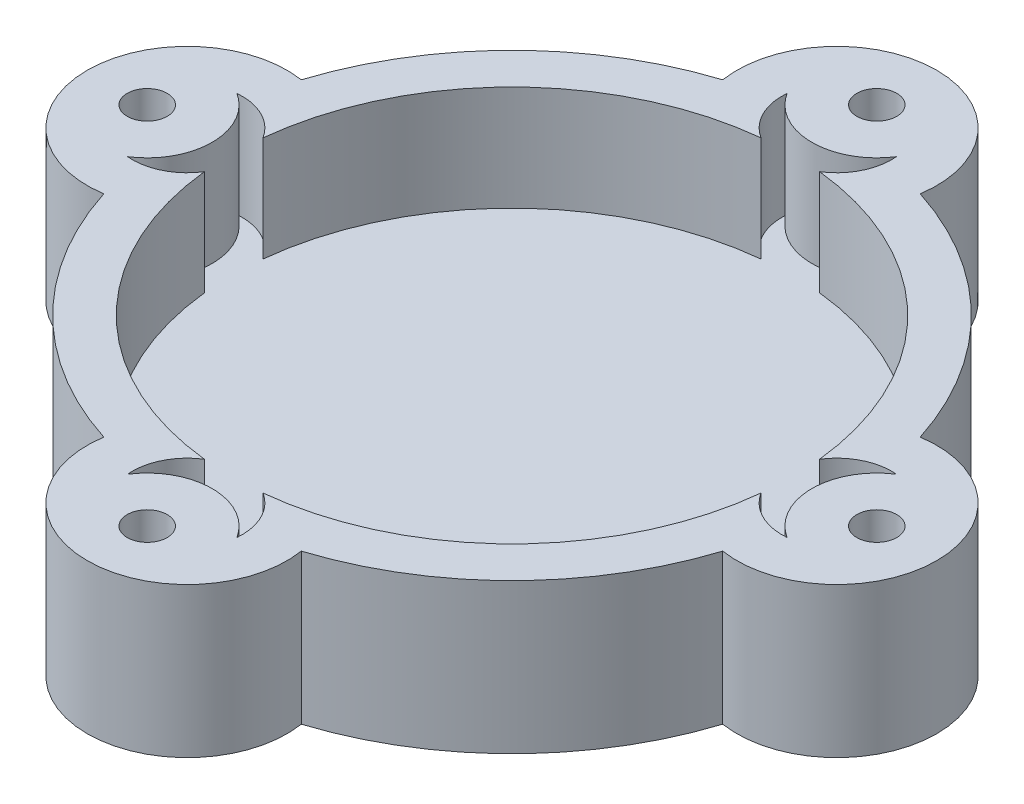
ISO-10303-21;
HEADER;
FILE_DESCRIPTION(('STEP AP214'),'2;1');
FILE_NAME('part.step','',(''),(''),'','','');
FILE_SCHEMA(('AUTOMOTIVE_DESIGN { 1 0 10303 214 1 1 1 1 }'));
ENDSEC;
DATA;
#1=APPLICATION_CONTEXT('core data for automotive mechanical design processes');
#2=APPLICATION_PROTOCOL_DEFINITION('international standard','automotive_design',2000,#1);
#3=PRODUCT_CONTEXT('',#1,'mechanical');
#4=PRODUCT('Part','Part','',(#3));
#5=PRODUCT_RELATED_PRODUCT_CATEGORY('part','',(#4));
#6=PRODUCT_DEFINITION_FORMATION('','',#4);
#7=PRODUCT_DEFINITION_CONTEXT('part definition',#1,'design');
#8=PRODUCT_DEFINITION('design','',#6,#7);
#9=PRODUCT_DEFINITION_SHAPE('','',#8);
#10=(LENGTH_UNIT() NAMED_UNIT(*) SI_UNIT(.MILLI.,.METRE.));
#11=(NAMED_UNIT(*) PLANE_ANGLE_UNIT() SI_UNIT($,.RADIAN.));
#12=(NAMED_UNIT(*) SI_UNIT($,.STERADIAN.) SOLID_ANGLE_UNIT());
#13=UNCERTAINTY_MEASURE_WITH_UNIT(LENGTH_MEASURE(1.E-05),#10,'distance_accuracy_value','');
#14=(GEOMETRIC_REPRESENTATION_CONTEXT(3) GLOBAL_UNCERTAINTY_ASSIGNED_CONTEXT((#13)) GLOBAL_UNIT_ASSIGNED_CONTEXT((#10,
#11,#12)) REPRESENTATION_CONTEXT('',''));
#15=CARTESIAN_POINT('',(0.,0.,0.));
#16=DIRECTION('',(0.,0.,1.));
#17=DIRECTION('',(1.,0.,0.));
#18=AXIS2_PLACEMENT_3D('',#15,#16,#17);
#19=CARTESIAN_POINT('',(-64.9999999999963,30.,3.69482222595252E-12));
#20=DIRECTION('',(0.,-1.,0.));
#21=DIRECTION('',(0.,0.,-1.));
#22=AXIS2_PLACEMENT_3D('',#19,#20,#21);
#23=CYLINDRICAL_SURFACE('',#22,20.);
#24=CARTESIAN_POINT('',(-64.9999999999963,0.,3.69482222595252E-12));
#25=DIRECTION('',(0.,1.,0.));
#26=DIRECTION('',(0.,0.,1.));
#27=AXIS2_PLACEMENT_3D('',#24,#25,#26);
#28=CIRCLE('',#27,20.);
#29=CARTESIAN_POINT('',(-61.9230769230779,0.,-19.7618962748665));
#30=VERTEX_POINT('',#29);
#31=CARTESIAN_POINT('',(-61.9230769230756,0.,19.7618962748735));
#32=VERTEX_POINT('',#31);
#33=EDGE_CURVE('E176',#30,#32,#28,.T.);
#34=ORIENTED_EDGE('',*,*,#33,.T.);
#35=DIRECTION('',(0.,-1.,0.));
#36=VECTOR('',#35,1.);
#37=CARTESIAN_POINT('',(-61.9230769230756,30.,19.7618962748735));
#38=LINE('',#37,#36);
#39=CARTESIAN_POINT('',(-61.9230769230756,30.,19.7618962748735));
#40=VERTEX_POINT('',#39);
#41=EDGE_CURVE('E11',#40,#32,#38,.T.);
#42=ORIENTED_EDGE('',*,*,#41,.F.);
#43=CARTESIAN_POINT('',(-64.9999999999963,30.,3.69482222595252E-12));
#44=DIRECTION('',(0.,1.,0.));
#45=DIRECTION('',(0.,0.,1.));
#46=AXIS2_PLACEMENT_3D('',#43,#44,#45);
#47=CIRCLE('',#46,20.);
#48=CARTESIAN_POINT('',(-61.9230769230779,30.,-19.7618962748665));
#49=VERTEX_POINT('',#48);
#50=EDGE_CURVE('E242',#49,#40,#47,.T.);
#51=ORIENTED_EDGE('',*,*,#50,.F.);
#52=DIRECTION('',(0.,-1.,0.));
#53=VECTOR('',#52,1.);
#54=CARTESIAN_POINT('',(-61.9230769230779,30.,-19.7618962748665));
#55=LINE('',#54,#53);
#56=EDGE_CURVE('E171',#49,#30,#55,.T.);
#57=ORIENTED_EDGE('',*,*,#56,.T.);
#58=EDGE_LOOP('',(#34,#42,#51,#57));
#59=FACE_BOUND('',#58,.T.);
#60=ADVANCED_FACE('F45',(#59),#23,.T.);
#61=CARTESIAN_POINT('',(0.,30.,0.));
#62=DIRECTION('',(0.,-1.,0.));
#63=DIRECTION('',(0.,0.,-1.));
#64=AXIS2_PLACEMENT_3D('',#61,#62,#63);
#65=CYLINDRICAL_SURFACE('',#64,65.);
#66=CARTESIAN_POINT('',(0.,0.,0.));
#67=DIRECTION('',(0.,1.,0.));
#68=DIRECTION('',(0.,0.,1.));
#69=AXIS2_PLACEMENT_3D('',#66,#67,#68);
#70=CIRCLE('',#69,65.);
#71=CARTESIAN_POINT('',(-19.7618962748624,0.,61.9230769230792));
#72=VERTEX_POINT('',#71);
#73=EDGE_CURVE('E181',#32,#72,#70,.T.);
#74=ORIENTED_EDGE('',*,*,#73,.T.);
#75=DIRECTION('',(0.,-1.,0.));
#76=VECTOR('',#75,1.);
#77=CARTESIAN_POINT('',(-19.7618962748624,30.,61.9230769230792));
#78=LINE('',#77,#76);
#79=CARTESIAN_POINT('',(-19.7618962748624,30.,61.9230769230792));
#80=VERTEX_POINT('',#79);
#81=EDGE_CURVE('E54',#80,#72,#78,.T.);
#82=ORIENTED_EDGE('',*,*,#81,.F.);
#83=CARTESIAN_POINT('',(0.,30.,0.));
#84=DIRECTION('',(0.,1.,0.));
#85=DIRECTION('',(0.,0.,1.));
#86=AXIS2_PLACEMENT_3D('',#83,#84,#85);
#87=CIRCLE('',#86,65.);
#88=EDGE_CURVE('E111',#40,#80,#87,.T.);
#89=ORIENTED_EDGE('',*,*,#88,.F.);
#90=ORIENTED_EDGE('',*,*,#41,.T.);
#91=EDGE_LOOP('',(#74,#82,#89,#90));
#92=FACE_BOUND('',#91,.T.);
#93=ADVANCED_FACE('F578',(#92),#65,.T.);
#94=CARTESIAN_POINT('',(7.37372404351613E-12,30.,65.));
#95=DIRECTION('',(0.,-1.,0.));
#96=DIRECTION('',(0.,0.,-1.));
#97=AXIS2_PLACEMENT_3D('',#94,#95,#96);
#98=CYLINDRICAL_SURFACE('',#97,20.);
#99=CARTESIAN_POINT('',(7.37372404351613E-12,0.,65.));
#100=DIRECTION('',(0.,1.,0.));
#101=DIRECTION('',(0.,0.,1.));
#102=AXIS2_PLACEMENT_3D('',#99,#100,#101);
#103=CIRCLE('',#102,20.);
#104=CARTESIAN_POINT('',(19.7618962748765,0.,61.9230769230747));
#105=VERTEX_POINT('',#104);
#106=EDGE_CURVE('E184',#72,#105,#103,.T.);
#107=ORIENTED_EDGE('',*,*,#106,.T.);
#108=DIRECTION('',(0.,-1.,0.));
#109=VECTOR('',#108,1.);
#110=CARTESIAN_POINT('',(19.7618962748765,30.,61.9230769230747));
#111=LINE('',#110,#109);
#112=CARTESIAN_POINT('',(19.7618962748765,30.,61.9230769230747));
#113=VERTEX_POINT('',#112);
#114=EDGE_CURVE('E217',#113,#105,#111,.T.);
#115=ORIENTED_EDGE('',*,*,#114,.F.);
#116=CARTESIAN_POINT('',(7.37372404351613E-12,30.,65.));
#117=DIRECTION('',(0.,1.,0.));
#118=DIRECTION('',(0.,0.,1.));
#119=AXIS2_PLACEMENT_3D('',#116,#117,#118);
#120=CIRCLE('',#119,20.);
#121=EDGE_CURVE('E227',#80,#113,#120,.T.);
#122=ORIENTED_EDGE('',*,*,#121,.F.);
#123=ORIENTED_EDGE('',*,*,#81,.T.);
#124=EDGE_LOOP('',(#107,#115,#122,#123));
#125=FACE_BOUND('',#124,.T.);
#126=ADVANCED_FACE('F225',(#125),#98,.T.);
#127=CARTESIAN_POINT('',(61.9230769230795,0.,19.7618962748654));
#128=VERTEX_POINT('',#127);
#129=EDGE_CURVE('E185',#105,#128,#70,.T.);
#130=ORIENTED_EDGE('',*,*,#129,.T.);
#131=DIRECTION('',(0.,-1.,0.));
#132=VECTOR('',#131,1.);
#133=CARTESIAN_POINT('',(61.9230769230795,30.,19.7618962748654));
#134=LINE('',#133,#132);
#135=CARTESIAN_POINT('',(61.9230769230795,30.,19.7618962748654));
#136=VERTEX_POINT('',#135);
#137=EDGE_CURVE('E213',#136,#128,#134,.T.);
#138=ORIENTED_EDGE('',*,*,#137,.F.);
#139=EDGE_CURVE('E140',#113,#136,#87,.T.);
#140=ORIENTED_EDGE('',*,*,#139,.F.);
#141=ORIENTED_EDGE('',*,*,#114,.T.);
#142=EDGE_LOOP('',(#130,#138,#140,#141));
#143=FACE_BOUND('',#142,.T.);
#144=ADVANCED_FACE('F584',(#143),#65,.T.);
#145=CARTESIAN_POINT('',(65.0000000000037,30.,-3.68686202175806E-12));
#146=DIRECTION('',(0.,-1.,0.));
#147=DIRECTION('',(0.,0.,-1.));
#148=AXIS2_PLACEMENT_3D('',#145,#146,#147);
#149=CYLINDRICAL_SURFACE('',#148,20.);
#150=CARTESIAN_POINT('',(65.0000000000037,0.,-3.68686202175806E-12));
#151=DIRECTION('',(0.,1.,0.));
#152=DIRECTION('',(0.,0.,1.));
#153=AXIS2_PLACEMENT_3D('',#150,#151,#152);
#154=CIRCLE('',#153,20.);
#155=CARTESIAN_POINT('',(61.9230769230784,0.,-19.7618962748724));
#156=VERTEX_POINT('',#155);
#157=EDGE_CURVE('E188',#128,#156,#154,.T.);
#158=ORIENTED_EDGE('',*,*,#157,.T.);
#159=DIRECTION('',(0.,-1.,0.));
#160=VECTOR('',#159,1.);
#161=CARTESIAN_POINT('',(61.9230769230784,30.,-19.7618962748724));
#162=LINE('',#161,#160);
#163=CARTESIAN_POINT('',(61.9230769230784,30.,-19.7618962748724));
#164=VERTEX_POINT('',#163);
#165=EDGE_CURVE('E149',#164,#156,#162,.T.);
#166=ORIENTED_EDGE('',*,*,#165,.F.);
#167=CARTESIAN_POINT('',(65.0000000000037,30.,-3.68686202175806E-12));
#168=DIRECTION('',(0.,1.,0.));
#169=DIRECTION('',(0.,0.,1.));
#170=AXIS2_PLACEMENT_3D('',#167,#168,#169);
#171=CIRCLE('',#170,20.);
#172=EDGE_CURVE('E134',#136,#164,#171,.T.);
#173=ORIENTED_EDGE('',*,*,#172,.F.);
#174=ORIENTED_EDGE('',*,*,#137,.T.);
#175=EDGE_LOOP('',(#158,#166,#173,#174));
#176=FACE_BOUND('',#175,.T.);
#177=ADVANCED_FACE('F589',(#176),#149,.T.);
#178=CARTESIAN_POINT('',(19.7618962748694,0.,-61.9230769230769));
#179=VERTEX_POINT('',#178);
#180=EDGE_CURVE('E145',#156,#179,#70,.T.);
#181=ORIENTED_EDGE('',*,*,#180,.T.);
#182=DIRECTION('',(0.,-1.,0.));
#183=VECTOR('',#182,1.);
#184=CARTESIAN_POINT('',(19.7618962748694,30.,-61.9230769230769));
#185=LINE('',#184,#183);
#186=CARTESIAN_POINT('',(19.7618962748694,30.,-61.9230769230769));
#187=VERTEX_POINT('',#186);
#188=EDGE_CURVE('E142',#187,#179,#185,.T.);
#189=ORIENTED_EDGE('',*,*,#188,.F.);
#190=EDGE_CURVE('E126',#164,#187,#87,.T.);
#191=ORIENTED_EDGE('',*,*,#190,.F.);
#192=ORIENTED_EDGE('',*,*,#165,.T.);
#193=EDGE_LOOP('',(#181,#189,#191,#192));
#194=FACE_BOUND('',#193,.T.);
#195=ADVANCED_FACE('F143',(#194),#65,.T.);
#196=CARTESIAN_POINT('',(0.,30.,-65.));
#197=DIRECTION('',(0.,-1.,0.));
#198=DIRECTION('',(0.,0.,-1.));
#199=AXIS2_PLACEMENT_3D('',#196,#197,#198);
#200=CYLINDRICAL_SURFACE('',#199,20.);
#201=CARTESIAN_POINT('',(0.,0.,-65.));
#202=DIRECTION('',(0.,1.,0.));
#203=DIRECTION('',(0.,0.,1.));
#204=AXIS2_PLACEMENT_3D('',#201,#202,#203);
#205=CIRCLE('',#204,20.);
#206=CARTESIAN_POINT('',(-19.7618962748694,0.,-61.9230769230769));
#207=VERTEX_POINT('',#206);
#208=EDGE_CURVE('E191',#179,#207,#205,.T.);
#209=ORIENTED_EDGE('',*,*,#208,.T.);
#210=DIRECTION('',(0.,-1.,0.));
#211=VECTOR('',#210,1.);
#212=CARTESIAN_POINT('',(-19.7618962748694,30.,-61.9230769230769));
#213=LINE('',#212,#211);
#214=CARTESIAN_POINT('',(-19.7618962748694,30.,-61.9230769230769));
#215=VERTEX_POINT('',#214);
#216=EDGE_CURVE('E150',#215,#207,#213,.T.);
#217=ORIENTED_EDGE('',*,*,#216,.F.);
#218=CARTESIAN_POINT('',(0.,30.,-65.));
#219=DIRECTION('',(0.,1.,0.));
#220=DIRECTION('',(0.,0.,1.));
#221=AXIS2_PLACEMENT_3D('',#218,#219,#220);
#222=CIRCLE('',#221,20.);
#223=EDGE_CURVE('E131',#187,#215,#222,.T.);
#224=ORIENTED_EDGE('',*,*,#223,.F.);
#225=ORIENTED_EDGE('',*,*,#188,.T.);
#226=EDGE_LOOP('',(#209,#217,#224,#225));
#227=FACE_BOUND('',#226,.T.);
#228=ADVANCED_FACE('F152',(#227),#200,.T.);
#229=CARTESIAN_POINT('',(73.0000000000037,30.,-3.68735188047772E-12));
#230=DIRECTION('',(0.,-1.,0.));
#231=DIRECTION('',(0.,0.,-1.));
#232=AXIS2_PLACEMENT_3D('',#229,#230,#231);
#233=CYLINDRICAL_SURFACE('',#232,4.0000000000027);
#234=CARTESIAN_POINT('',(73.0000000000037,30.,-3.68735188047772E-12));
#235=DIRECTION('',(0.,1.,0.));
#236=DIRECTION('',(0.,0.,1.));
#237=AXIS2_PLACEMENT_3D('',#234,#235,#236);
#238=CIRCLE('',#237,4.0000000000027);
#239=CARTESIAN_POINT('',(73.0000000000037,30.,3.99999999999901));
#240=VERTEX_POINT('',#239);
#241=EDGE_CURVE('E163',#240,#240,#238,.T.);
#242=ORIENTED_EDGE('',*,*,#241,.T.);
#243=EDGE_LOOP('',(#242));
#244=FACE_BOUND('',#243,.T.);
#245=CARTESIAN_POINT('',(73.0000000000037,0.,-3.68735188047772E-12));
#246=DIRECTION('',(0.,1.,0.));
#247=DIRECTION('',(0.,0.,1.));
#248=AXIS2_PLACEMENT_3D('',#245,#246,#247);
#249=CIRCLE('',#248,4.0000000000027);
#250=CARTESIAN_POINT('',(73.0000000000037,0.,3.99999999999901));
#251=VERTEX_POINT('',#250);
#252=EDGE_CURVE('E198',#251,#251,#249,.T.);
#253=ORIENTED_EDGE('',*,*,#252,.F.);
#254=EDGE_LOOP('',(#253));
#255=FACE_BOUND('',#254,.T.);
#256=ADVANCED_FACE('F594',(#244,#255),#233,.F.);
#257=CARTESIAN_POINT('',(0.,30.,-73.));
#258=DIRECTION('',(0.,-1.,0.));
#259=DIRECTION('',(0.,0.,-1.));
#260=AXIS2_PLACEMENT_3D('',#257,#258,#259);
#261=CYLINDRICAL_SURFACE('',#260,4.);
#262=CARTESIAN_POINT('',(0.,30.,-73.));
#263=DIRECTION('',(0.,1.,0.));
#264=DIRECTION('',(0.,0.,1.));
#265=AXIS2_PLACEMENT_3D('',#262,#263,#264);
#266=CIRCLE('',#265,4.);
#267=CARTESIAN_POINT('',(0.,30.,-69.));
#268=VERTEX_POINT('',#267);
#269=EDGE_CURVE('E156',#268,#268,#266,.T.);
#270=ORIENTED_EDGE('',*,*,#269,.T.);
#271=EDGE_LOOP('',(#270));
#272=FACE_BOUND('',#271,.T.);
#273=CARTESIAN_POINT('',(0.,0.,-73.));
#274=DIRECTION('',(0.,1.,0.));
#275=DIRECTION('',(0.,0.,1.));
#276=AXIS2_PLACEMENT_3D('',#273,#274,#275);
#277=CIRCLE('',#276,4.);
#278=CARTESIAN_POINT('',(0.,0.,-69.));
#279=VERTEX_POINT('',#278);
#280=EDGE_CURVE('E194',#279,#279,#277,.T.);
#281=ORIENTED_EDGE('',*,*,#280,.F.);
#282=EDGE_LOOP('',(#281));
#283=FACE_BOUND('',#282,.T.);
#284=ADVANCED_FACE('F597',(#272,#283),#261,.F.);
#285=EDGE_CURVE('E103',#207,#30,#70,.T.);
#286=ORIENTED_EDGE('',*,*,#285,.T.);
#287=ORIENTED_EDGE('',*,*,#56,.F.);
#288=EDGE_CURVE('E70',#215,#49,#87,.T.);
#289=ORIENTED_EDGE('',*,*,#288,.F.);
#290=ORIENTED_EDGE('',*,*,#216,.T.);
#291=EDGE_LOOP('',(#286,#287,#289,#290));
#292=FACE_BOUND('',#291,.T.);
#293=ADVANCED_FACE('F585',(#292),#65,.T.);
#294=CARTESIAN_POINT('',(-72.9999999999963,30.,3.6962918021115E-12));
#295=DIRECTION('',(0.,-1.,0.));
#296=DIRECTION('',(0.,0.,-1.));
#297=AXIS2_PLACEMENT_3D('',#294,#295,#296);
#298=CYLINDRICAL_SURFACE('',#297,4.00000000000534);
#299=CARTESIAN_POINT('',(-72.9999999999963,30.,3.6962918021115E-12));
#300=DIRECTION('',(0.,1.,0.));
#301=DIRECTION('',(0.,0.,1.));
#302=AXIS2_PLACEMENT_3D('',#299,#300,#301);
#303=CIRCLE('',#302,4.00000000000534);
#304=CARTESIAN_POINT('',(-72.9999999999963,30.,4.00000000000904));
#305=VERTEX_POINT('',#304);
#306=EDGE_CURVE('E206',#305,#305,#303,.T.);
#307=ORIENTED_EDGE('',*,*,#306,.T.);
#308=EDGE_LOOP('',(#307));
#309=FACE_BOUND('',#308,.T.);
#310=CARTESIAN_POINT('',(-72.9999999999963,0.,3.6962918021115E-12));
#311=DIRECTION('',(0.,1.,0.));
#312=DIRECTION('',(0.,0.,1.));
#313=AXIS2_PLACEMENT_3D('',#310,#311,#312);
#314=CIRCLE('',#313,4.00000000000534);
#315=CARTESIAN_POINT('',(-72.9999999999963,0.,4.00000000000904));
#316=VERTEX_POINT('',#315);
#317=EDGE_CURVE('E172',#316,#316,#314,.T.);
#318=ORIENTED_EDGE('',*,*,#317,.F.);
#319=EDGE_LOOP('',(#318));
#320=FACE_BOUND('',#319,.T.);
#321=ADVANCED_FACE('F47',(#309,#320),#298,.F.);
#322=CARTESIAN_POINT('',(7.37470376095544E-12,30.,73.));
#323=DIRECTION('',(0.,-1.,0.));
#324=DIRECTION('',(0.,0.,-1.));
#325=AXIS2_PLACEMENT_3D('',#322,#323,#324);
#326=CYLINDRICAL_SURFACE('',#325,4.00000000000754);
#327=CARTESIAN_POINT('',(7.37470376095544E-12,30.,73.));
#328=DIRECTION('',(0.,1.,0.));
#329=DIRECTION('',(0.,0.,1.));
#330=AXIS2_PLACEMENT_3D('',#327,#328,#329);
#331=CIRCLE('',#330,4.00000000000754);
#332=CARTESIAN_POINT('',(7.37470376095544E-12,30.,77.0000000000075));
#333=VERTEX_POINT('',#332);
#334=EDGE_CURVE('E167',#333,#333,#331,.T.);
#335=ORIENTED_EDGE('',*,*,#334,.T.);
#336=EDGE_LOOP('',(#335));
#337=FACE_BOUND('',#336,.T.);
#338=CARTESIAN_POINT('',(7.37470376095544E-12,0.,73.));
#339=DIRECTION('',(0.,1.,0.));
#340=DIRECTION('',(0.,0.,1.));
#341=AXIS2_PLACEMENT_3D('',#338,#339,#340);
#342=CIRCLE('',#341,4.00000000000754);
#343=CARTESIAN_POINT('',(7.37470376095544E-12,0.,77.0000000000075));
#344=VERTEX_POINT('',#343);
#345=EDGE_CURVE('E202',#344,#344,#342,.T.);
#346=ORIENTED_EDGE('',*,*,#345,.F.);
#347=EDGE_LOOP('',(#346));
#348=FACE_BOUND('',#347,.T.);
#349=ADVANCED_FACE('F604',(#337,#348),#326,.F.);
#350=CARTESIAN_POINT('',(0.,30.,0.));
#351=DIRECTION('',(0.,1.,0.));
#352=DIRECTION('',(0.,0.,1.));
#353=AXIS2_PLACEMENT_3D('',#350,#351,#352);
#354=PLANE('',#353);
#355=CARTESIAN_POINT('',(7.37372404351613E-12,30.,65.));
#356=DIRECTION('',(0.,1.,0.));
#357=DIRECTION('',(0.,0.,1.));
#358=AXIS2_PLACEMENT_3D('',#355,#356,#357);
#359=CIRCLE('',#358,11.);
#360=CARTESIAN_POINT('',(-5.86232581022681,30.,55.6923076923084));
#361=VERTEX_POINT('',#360);
#362=CARTESIAN_POINT('',(-10.9544511500971,30.,65.9999999999878));
#363=VERTEX_POINT('',#362);
#364=EDGE_CURVE('E323',#361,#363,#359,.T.);
#365=ORIENTED_EDGE('',*,*,#364,.F.);
#366=CARTESIAN_POINT('',(0.,30.,0.));
#367=DIRECTION('',(0.,1.,0.));
#368=DIRECTION('',(0.,0.,1.));
#369=AXIS2_PLACEMENT_3D('',#366,#367,#368);
#370=CIRCLE('',#369,56.);
#371=CARTESIAN_POINT('',(-55.6923076923068,30.,5.8623258102413));
#372=VERTEX_POINT('',#371);
#373=EDGE_CURVE('E328',#372,#361,#370,.T.);
#374=ORIENTED_EDGE('',*,*,#373,.F.);
#375=CARTESIAN_POINT('',(-64.9999999999963,30.,3.69482222595252E-12));
#376=DIRECTION('',(0.,1.,0.));
#377=DIRECTION('',(0.,0.,1.));
#378=AXIS2_PLACEMENT_3D('',#375,#376,#377);
#379=CIRCLE('',#378,11.);
#380=CARTESIAN_POINT('',(-65.9999999999877,30.,10.9544511501078));
#381=VERTEX_POINT('',#380);
#382=EDGE_CURVE('E292',#381,#372,#379,.T.);
#383=ORIENTED_EDGE('',*,*,#382,.F.);
#384=CARTESIAN_POINT('',(-72.9999999999963,30.,3.6962918021115E-12));
#385=DIRECTION('',(0.,1.,0.));
#386=DIRECTION('',(0.,0.,1.));
#387=AXIS2_PLACEMENT_3D('',#384,#385,#386);
#388=CIRCLE('',#387,13.0000000000053);
#389=CARTESIAN_POINT('',(-65.9999999999877,30.,-10.9544511501004));
#390=VERTEX_POINT('',#389);
#391=EDGE_CURVE('E288',#381,#390,#388,.T.);
#392=ORIENTED_EDGE('',*,*,#391,.T.);
#393=CARTESIAN_POINT('',(-55.6923076923075,30.,-5.86232581023497));
#394=VERTEX_POINT('',#393);
#395=EDGE_CURVE('E331',#394,#390,#379,.T.);
#396=ORIENTED_EDGE('',*,*,#395,.F.);
#397=CARTESIAN_POINT('',(0.,30.,0.));
#398=DIRECTION('',(0.,1.,0.));
#399=DIRECTION('',(0.,0.,1.));
#400=AXIS2_PLACEMENT_3D('',#397,#398,#399);
#401=CIRCLE('',#400,56.);
#402=CARTESIAN_POINT('',(-5.86232581023313,30.,-55.6923076923077));
#403=VERTEX_POINT('',#402);
#404=EDGE_CURVE('E298',#403,#394,#401,.T.);
#405=ORIENTED_EDGE('',*,*,#404,.F.);
#406=CARTESIAN_POINT('',(0.,30.,-65.));
#407=DIRECTION('',(0.,1.,0.));
#408=DIRECTION('',(0.,0.,1.));
#409=AXIS2_PLACEMENT_3D('',#406,#407,#408);
#410=CIRCLE('',#409,11.);
#411=CARTESIAN_POINT('',(-10.9544511501033,30.,-66.));
#412=VERTEX_POINT('',#411);
#413=EDGE_CURVE('E309',#412,#403,#410,.T.);
#414=ORIENTED_EDGE('',*,*,#413,.F.);
#415=CARTESIAN_POINT('',(0.,30.,-73.));
#416=DIRECTION('',(0.,1.,0.));
#417=DIRECTION('',(0.,0.,1.));
#418=AXIS2_PLACEMENT_3D('',#415,#416,#417);
#419=CIRCLE('',#418,13.);
#420=CARTESIAN_POINT('',(10.9544511501033,30.,-66.));
#421=VERTEX_POINT('',#420);
#422=EDGE_CURVE('E294',#412,#421,#419,.T.);
#423=ORIENTED_EDGE('',*,*,#422,.T.);
#424=CARTESIAN_POINT('',(5.86232581023313,30.,-55.6923076923077));
#425=VERTEX_POINT('',#424);
#426=EDGE_CURVE('E305',#425,#421,#410,.T.);
#427=ORIENTED_EDGE('',*,*,#426,.F.);
#428=CARTESIAN_POINT('',(0.,30.,0.));
#429=DIRECTION('',(0.,1.,0.));
#430=DIRECTION('',(0.,0.,1.));
#431=AXIS2_PLACEMENT_3D('',#428,#429,#430);
#432=CIRCLE('',#431,56.);
#433=CARTESIAN_POINT('',(55.6923076923079,30.,-5.86232581023128));
#434=VERTEX_POINT('',#433);
#435=EDGE_CURVE('E310',#434,#425,#432,.T.);
#436=ORIENTED_EDGE('',*,*,#435,.F.);
#437=CARTESIAN_POINT('',(65.0000000000037,30.,-3.68686202175806E-12));
#438=DIRECTION('',(0.,1.,0.));
#439=DIRECTION('',(0.,0.,1.));
#440=AXIS2_PLACEMENT_3D('',#437,#438,#439);
#441=CIRCLE('',#440,11.);
#442=CARTESIAN_POINT('',(65.9999999999993,30.,-10.9544511501074));
#443=VERTEX_POINT('',#442);
#444=EDGE_CURVE('E318',#443,#434,#441,.T.);
#445=ORIENTED_EDGE('',*,*,#444,.F.);
#446=CARTESIAN_POINT('',(73.0000000000037,30.,-3.68735188047772E-12));
#447=DIRECTION('',(0.,1.,0.));
#448=DIRECTION('',(0.,0.,1.));
#449=AXIS2_PLACEMENT_3D('',#446,#447,#448);
#450=CIRCLE('',#449,13.0000000000027);
#451=CARTESIAN_POINT('',(65.9999999999993,30.,10.9544511501));
#452=VERTEX_POINT('',#451);
#453=EDGE_CURVE('E287',#443,#452,#450,.T.);
#454=ORIENTED_EDGE('',*,*,#453,.T.);
#455=CARTESIAN_POINT('',(55.6923076923085,30.,5.86232581022495));
#456=VERTEX_POINT('',#455);
#457=EDGE_CURVE('E314',#456,#452,#441,.T.);
#458=ORIENTED_EDGE('',*,*,#457,.F.);
#459=CARTESIAN_POINT('',(0.,30.,0.));
#460=DIRECTION('',(0.,1.,0.));
#461=DIRECTION('',(0.,0.,1.));
#462=AXIS2_PLACEMENT_3D('',#459,#460,#461);
#463=CIRCLE('',#462,56.);
#464=CARTESIAN_POINT('',(5.86232581023945,30.,55.692307692307));
#465=VERTEX_POINT('',#464);
#466=EDGE_CURVE('E319',#465,#456,#463,.T.);
#467=ORIENTED_EDGE('',*,*,#466,.F.);
#468=CARTESIAN_POINT('',(10.9544511501118,30.,65.9999999999878));
#469=VERTEX_POINT('',#468);
#470=EDGE_CURVE('E327',#469,#465,#359,.T.);
#471=ORIENTED_EDGE('',*,*,#470,.F.);
#472=CARTESIAN_POINT('',(7.37470376095544E-12,30.,73.));
#473=DIRECTION('',(0.,1.,0.));
#474=DIRECTION('',(0.,0.,1.));
#475=AXIS2_PLACEMENT_3D('',#472,#473,#474);
#476=CIRCLE('',#475,13.0000000000075);
#477=EDGE_CURVE('E282',#469,#363,#476,.T.);
#478=ORIENTED_EDGE('',*,*,#477,.T.);
#479=EDGE_LOOP('',(#365,#374,#383,#392,#396,#405,#414,#423,#427,#436,#445,#454,#458,#467,#471,#478));
#480=FACE_BOUND('',#479,.T.);
#481=ORIENTED_EDGE('',*,*,#306,.F.);
#482=EDGE_LOOP('',(#481));
#483=FACE_BOUND('',#482,.T.);
#484=ORIENTED_EDGE('',*,*,#50,.T.);
#485=ORIENTED_EDGE('',*,*,#88,.T.);
#486=ORIENTED_EDGE('',*,*,#121,.T.);
#487=ORIENTED_EDGE('',*,*,#139,.T.);
#488=ORIENTED_EDGE('',*,*,#172,.T.);
#489=ORIENTED_EDGE('',*,*,#190,.T.);
#490=ORIENTED_EDGE('',*,*,#223,.T.);
#491=ORIENTED_EDGE('',*,*,#288,.T.);
#492=EDGE_LOOP('',(#484,#485,#486,#487,#488,#489,#490,#491));
#493=FACE_BOUND('',#492,.T.);
#494=ORIENTED_EDGE('',*,*,#269,.F.);
#495=EDGE_LOOP('',(#494));
#496=FACE_BOUND('',#495,.T.);
#497=ORIENTED_EDGE('',*,*,#241,.F.);
#498=EDGE_LOOP('',(#497));
#499=FACE_BOUND('',#498,.T.);
#500=ORIENTED_EDGE('',*,*,#334,.F.);
#501=EDGE_LOOP('',(#500));
#502=FACE_BOUND('',#501,.T.);
#503=ADVANCED_FACE('F128',(#480,#483,#493,#496,#499,#502),#354,.T.);
#504=CARTESIAN_POINT('',(0.,0.,0.));
#505=DIRECTION('',(0.,1.,0.));
#506=DIRECTION('',(0.,0.,1.));
#507=AXIS2_PLACEMENT_3D('',#504,#505,#506);
#508=PLANE('',#507);
#509=ORIENTED_EDGE('',*,*,#317,.T.);
#510=EDGE_LOOP('',(#509));
#511=FACE_BOUND('',#510,.T.);
#512=ORIENTED_EDGE('',*,*,#33,.F.);
#513=ORIENTED_EDGE('',*,*,#285,.F.);
#514=ORIENTED_EDGE('',*,*,#208,.F.);
#515=ORIENTED_EDGE('',*,*,#180,.F.);
#516=ORIENTED_EDGE('',*,*,#157,.F.);
#517=ORIENTED_EDGE('',*,*,#129,.F.);
#518=ORIENTED_EDGE('',*,*,#106,.F.);
#519=ORIENTED_EDGE('',*,*,#73,.F.);
#520=EDGE_LOOP('',(#512,#513,#514,#515,#516,#517,#518,#519));
#521=FACE_BOUND('',#520,.T.);
#522=ORIENTED_EDGE('',*,*,#280,.T.);
#523=EDGE_LOOP('',(#522));
#524=FACE_BOUND('',#523,.T.);
#525=ORIENTED_EDGE('',*,*,#252,.T.);
#526=EDGE_LOOP('',(#525));
#527=FACE_BOUND('',#526,.T.);
#528=ORIENTED_EDGE('',*,*,#345,.T.);
#529=EDGE_LOOP('',(#528));
#530=FACE_BOUND('',#529,.T.);
#531=ADVANCED_FACE('F231',(#511,#521,#524,#527,#530),#508,.F.);
#532=CARTESIAN_POINT('',(-64.9999999999963,30.,3.69482222595252E-12));
#533=DIRECTION('',(0.,-1.,0.));
#534=DIRECTION('',(0.,0.,-1.));
#535=AXIS2_PLACEMENT_3D('',#532,#533,#534);
#536=CYLINDRICAL_SURFACE('',#535,11.);
#537=DIRECTION('',(0.,1.,0.));
#538=VECTOR('',#537,1.);
#539=CARTESIAN_POINT('',(-65.9999999999877,30.,10.9544511501078));
#540=LINE('',#539,#538);
#541=CARTESIAN_POINT('',(-65.9999999999877,9.,10.9544511501078));
#542=VERTEX_POINT('',#541);
#543=EDGE_CURVE('E177',#542,#381,#540,.T.);
#544=ORIENTED_EDGE('',*,*,#543,.T.);
#545=ORIENTED_EDGE('',*,*,#382,.T.);
#546=DIRECTION('',(0.,-1.,0.));
#547=VECTOR('',#546,1.);
#548=CARTESIAN_POINT('',(-55.6923076923068,30.,5.8623258102413));
#549=LINE('',#548,#547);
#550=CARTESIAN_POINT('',(-55.6923076923068,9.,5.8623258102413));
#551=VERTEX_POINT('',#550);
#552=EDGE_CURVE('E61',#372,#551,#549,.T.);
#553=ORIENTED_EDGE('',*,*,#552,.T.);
#554=CARTESIAN_POINT('',(-64.9999999999963,9.,3.69482222595252E-12));
#555=DIRECTION('',(0.,1.,0.));
#556=DIRECTION('',(0.,0.,1.));
#557=AXIS2_PLACEMENT_3D('',#554,#555,#556);
#558=CIRCLE('',#557,11.);
#559=EDGE_CURVE('E406',#542,#551,#558,.T.);
#560=ORIENTED_EDGE('',*,*,#559,.F.);
#561=EDGE_LOOP('',(#544,#545,#553,#560));
#562=FACE_BOUND('',#561,.T.);
#563=ADVANCED_FACE('F441',(#562),#536,.F.);
#564=CARTESIAN_POINT('',(0.,30.,-65.));
#565=DIRECTION('',(0.,-1.,0.));
#566=DIRECTION('',(0.,0.,-1.));
#567=AXIS2_PLACEMENT_3D('',#564,#565,#566);
#568=CYLINDRICAL_SURFACE('',#567,11.);
#569=DIRECTION('',(0.,1.,0.));
#570=VECTOR('',#569,1.);
#571=CARTESIAN_POINT('',(-10.9544511501033,30.,-66.));
#572=LINE('',#571,#570);
#573=CARTESIAN_POINT('',(-10.9544511501033,9.,-66.));
#574=VERTEX_POINT('',#573);
#575=EDGE_CURVE('E258',#574,#412,#572,.T.);
#576=ORIENTED_EDGE('',*,*,#575,.T.);
#577=ORIENTED_EDGE('',*,*,#413,.T.);
#578=DIRECTION('',(0.,-1.,0.));
#579=VECTOR('',#578,1.);
#580=CARTESIAN_POINT('',(-5.86232581023313,30.,-55.6923076923077));
#581=LINE('',#580,#579);
#582=CARTESIAN_POINT('',(-5.86232581023313,9.,-55.6923076923077));
#583=VERTEX_POINT('',#582);
#584=EDGE_CURVE('E356',#403,#583,#581,.T.);
#585=ORIENTED_EDGE('',*,*,#584,.T.);
#586=CARTESIAN_POINT('',(0.,9.,-65.));
#587=DIRECTION('',(0.,1.,0.));
#588=DIRECTION('',(0.,0.,1.));
#589=AXIS2_PLACEMENT_3D('',#586,#587,#588);
#590=CIRCLE('',#589,11.);
#591=EDGE_CURVE('E355',#574,#583,#590,.T.);
#592=ORIENTED_EDGE('',*,*,#591,.F.);
#593=EDGE_LOOP('',(#576,#577,#585,#592));
#594=FACE_BOUND('',#593,.T.);
#595=ADVANCED_FACE('F557',(#594),#568,.F.);
#596=CARTESIAN_POINT('',(65.0000000000037,30.,-3.68686202175806E-12));
#597=DIRECTION('',(0.,-1.,0.));
#598=DIRECTION('',(0.,0.,-1.));
#599=AXIS2_PLACEMENT_3D('',#596,#597,#598);
#600=CYLINDRICAL_SURFACE('',#599,11.);
#601=DIRECTION('',(0.,1.,0.));
#602=VECTOR('',#601,1.);
#603=CARTESIAN_POINT('',(65.9999999999993,30.,-10.9544511501074));
#604=LINE('',#603,#602);
#605=CARTESIAN_POINT('',(65.9999999999993,9.,-10.9544511501074));
#606=VERTEX_POINT('',#605);
#607=EDGE_CURVE('E266',#606,#443,#604,.T.);
#608=ORIENTED_EDGE('',*,*,#607,.T.);
#609=ORIENTED_EDGE('',*,*,#444,.T.);
#610=DIRECTION('',(0.,-1.,0.));
#611=VECTOR('',#610,1.);
#612=CARTESIAN_POINT('',(55.6923076923079,30.,-5.86232581023128));
#613=LINE('',#612,#611);
#614=CARTESIAN_POINT('',(55.6923076923079,9.,-5.86232581023128));
#615=VERTEX_POINT('',#614);
#616=EDGE_CURVE('E368',#434,#615,#613,.T.);
#617=ORIENTED_EDGE('',*,*,#616,.T.);
#618=CARTESIAN_POINT('',(65.0000000000037,9.,-3.68686202175806E-12));
#619=DIRECTION('',(0.,1.,0.));
#620=DIRECTION('',(0.,0.,1.));
#621=AXIS2_PLACEMENT_3D('',#618,#619,#620);
#622=CIRCLE('',#621,11.);
#623=EDGE_CURVE('E373',#606,#615,#622,.T.);
#624=ORIENTED_EDGE('',*,*,#623,.F.);
#625=EDGE_LOOP('',(#608,#609,#617,#624));
#626=FACE_BOUND('',#625,.T.);
#627=ADVANCED_FACE('F539',(#626),#600,.F.);
#628=CARTESIAN_POINT('',(7.37372404351613E-12,30.,65.));
#629=DIRECTION('',(0.,-1.,0.));
#630=DIRECTION('',(0.,0.,-1.));
#631=AXIS2_PLACEMENT_3D('',#628,#629,#630);
#632=CYLINDRICAL_SURFACE('',#631,11.);
#633=DIRECTION('',(0.,1.,0.));
#634=VECTOR('',#633,1.);
#635=CARTESIAN_POINT('',(10.9544511501118,30.,65.9999999999878));
#636=LINE('',#635,#634);
#637=CARTESIAN_POINT('',(10.9544511501118,9.,65.9999999999878));
#638=VERTEX_POINT('',#637);
#639=EDGE_CURVE('E274',#638,#469,#636,.T.);
#640=ORIENTED_EDGE('',*,*,#639,.T.);
#641=ORIENTED_EDGE('',*,*,#470,.T.);
#642=DIRECTION('',(0.,-1.,0.));
#643=VECTOR('',#642,1.);
#644=CARTESIAN_POINT('',(5.86232581023945,30.,55.692307692307));
#645=LINE('',#644,#643);
#646=CARTESIAN_POINT('',(5.86232581023945,9.,55.692307692307));
#647=VERTEX_POINT('',#646);
#648=EDGE_CURVE('E385',#465,#647,#645,.T.);
#649=ORIENTED_EDGE('',*,*,#648,.T.);
#650=CARTESIAN_POINT('',(7.37372404351613E-12,9.,65.));
#651=DIRECTION('',(0.,1.,0.));
#652=DIRECTION('',(0.,0.,1.));
#653=AXIS2_PLACEMENT_3D('',#650,#651,#652);
#654=CIRCLE('',#653,11.);
#655=EDGE_CURVE('E390',#638,#647,#654,.T.);
#656=ORIENTED_EDGE('',*,*,#655,.F.);
#657=EDGE_LOOP('',(#640,#641,#649,#656));
#658=FACE_BOUND('',#657,.T.);
#659=ADVANCED_FACE('F572',(#658),#632,.F.);
#660=CARTESIAN_POINT('',(-55.6923076923075,9.,-5.86232581023497));
#661=VERTEX_POINT('',#660);
#662=CARTESIAN_POINT('',(-65.9999999999877,9.,-10.9544511501004));
#663=VERTEX_POINT('',#662);
#664=EDGE_CURVE('E351',#661,#663,#558,.T.);
#665=ORIENTED_EDGE('',*,*,#664,.F.);
#666=DIRECTION('',(0.,-1.,0.));
#667=VECTOR('',#666,1.);
#668=CARTESIAN_POINT('',(-55.6923076923075,30.,-5.86232581023497));
#669=LINE('',#668,#667);
#670=EDGE_CURVE('E286',#394,#661,#669,.T.);
#671=ORIENTED_EDGE('',*,*,#670,.F.);
#672=ORIENTED_EDGE('',*,*,#395,.T.);
#673=DIRECTION('',(0.,1.,0.));
#674=VECTOR('',#673,1.);
#675=CARTESIAN_POINT('',(-65.9999999999877,30.,-10.9544511501004));
#676=LINE('',#675,#674);
#677=EDGE_CURVE('E254',#663,#390,#676,.T.);
#678=ORIENTED_EDGE('',*,*,#677,.F.);
#679=EDGE_LOOP('',(#665,#671,#672,#678));
#680=FACE_BOUND('',#679,.T.);
#681=ADVANCED_FACE('F562',(#680),#536,.F.);
#682=CARTESIAN_POINT('',(0.,30.,0.));
#683=DIRECTION('',(0.,-1.,0.));
#684=DIRECTION('',(0.,0.,-1.));
#685=AXIS2_PLACEMENT_3D('',#682,#683,#684);
#686=CYLINDRICAL_SURFACE('',#685,56.);
#687=CARTESIAN_POINT('',(0.,9.,0.));
#688=DIRECTION('',(0.,1.,0.));
#689=DIRECTION('',(0.,0.,1.));
#690=AXIS2_PLACEMENT_3D('',#687,#688,#689);
#691=CIRCLE('',#690,56.);
#692=CARTESIAN_POINT('',(-5.86232581022681,9.,55.6923076923084));
#693=VERTEX_POINT('',#692);
#694=EDGE_CURVE('E402',#551,#693,#691,.T.);
#695=ORIENTED_EDGE('',*,*,#694,.F.);
#696=ORIENTED_EDGE('',*,*,#552,.F.);
#697=ORIENTED_EDGE('',*,*,#373,.T.);
#698=DIRECTION('',(0.,-1.,0.));
#699=VECTOR('',#698,1.);
#700=CARTESIAN_POINT('',(-5.86232581022681,30.,55.6923076923084));
#701=LINE('',#700,#699);
#702=EDGE_CURVE('E394',#361,#693,#701,.T.);
#703=ORIENTED_EDGE('',*,*,#702,.T.);
#704=EDGE_LOOP('',(#695,#696,#697,#703));
#705=FACE_BOUND('',#704,.T.);
#706=ADVANCED_FACE('F563',(#705),#686,.F.);
#707=CARTESIAN_POINT('',(-10.9544511500971,9.,65.9999999999878));
#708=VERTEX_POINT('',#707);
#709=EDGE_CURVE('E398',#693,#708,#654,.T.);
#710=ORIENTED_EDGE('',*,*,#709,.F.);
#711=ORIENTED_EDGE('',*,*,#702,.F.);
#712=ORIENTED_EDGE('',*,*,#364,.T.);
#713=DIRECTION('',(0.,1.,0.));
#714=VECTOR('',#713,1.);
#715=CARTESIAN_POINT('',(-10.9544511500971,30.,65.9999999999878));
#716=LINE('',#715,#714);
#717=EDGE_CURVE('E278',#708,#363,#716,.T.);
#718=ORIENTED_EDGE('',*,*,#717,.F.);
#719=EDGE_LOOP('',(#710,#711,#712,#718));
#720=FACE_BOUND('',#719,.T.);
#721=ADVANCED_FACE('F473',(#720),#632,.F.);
#722=CARTESIAN_POINT('',(0.,9.,0.));
#723=DIRECTION('',(0.,1.,0.));
#724=DIRECTION('',(0.,0.,1.));
#725=AXIS2_PLACEMENT_3D('',#722,#723,#724);
#726=CIRCLE('',#725,56.);
#727=CARTESIAN_POINT('',(55.6923076923085,9.,5.86232581022495));
#728=VERTEX_POINT('',#727);
#729=EDGE_CURVE('E386',#647,#728,#726,.T.);
#730=ORIENTED_EDGE('',*,*,#729,.F.);
#731=ORIENTED_EDGE('',*,*,#648,.F.);
#732=ORIENTED_EDGE('',*,*,#466,.T.);
#733=DIRECTION('',(0.,-1.,0.));
#734=VECTOR('',#733,1.);
#735=CARTESIAN_POINT('',(55.6923076923085,30.,5.86232581022495));
#736=LINE('',#735,#734);
#737=EDGE_CURVE('E377',#456,#728,#736,.T.);
#738=ORIENTED_EDGE('',*,*,#737,.T.);
#739=EDGE_LOOP('',(#730,#731,#732,#738));
#740=FACE_BOUND('',#739,.T.);
#741=ADVANCED_FACE('F566',(#740),#686,.F.);
#742=CARTESIAN_POINT('',(65.9999999999993,9.,10.9544511501));
#743=VERTEX_POINT('',#742);
#744=EDGE_CURVE('E381',#728,#743,#622,.T.);
#745=ORIENTED_EDGE('',*,*,#744,.F.);
#746=ORIENTED_EDGE('',*,*,#737,.F.);
#747=ORIENTED_EDGE('',*,*,#457,.T.);
#748=DIRECTION('',(0.,1.,0.));
#749=VECTOR('',#748,1.);
#750=CARTESIAN_POINT('',(65.9999999999993,30.,10.9544511501));
#751=LINE('',#750,#749);
#752=EDGE_CURVE('E270',#743,#452,#751,.T.);
#753=ORIENTED_EDGE('',*,*,#752,.F.);
#754=EDGE_LOOP('',(#745,#746,#747,#753));
#755=FACE_BOUND('',#754,.T.);
#756=ADVANCED_FACE('F529',(#755),#600,.F.);
#757=CARTESIAN_POINT('',(0.,9.,0.));
#758=DIRECTION('',(0.,1.,0.));
#759=DIRECTION('',(0.,0.,1.));
#760=AXIS2_PLACEMENT_3D('',#757,#758,#759);
#761=CIRCLE('',#760,56.);
#762=CARTESIAN_POINT('',(5.86232581023313,9.,-55.6923076923077));
#763=VERTEX_POINT('',#762);
#764=EDGE_CURVE('E369',#615,#763,#761,.T.);
#765=ORIENTED_EDGE('',*,*,#764,.F.);
#766=ORIENTED_EDGE('',*,*,#616,.F.);
#767=ORIENTED_EDGE('',*,*,#435,.T.);
#768=DIRECTION('',(0.,-1.,0.));
#769=VECTOR('',#768,1.);
#770=CARTESIAN_POINT('',(5.86232581023313,30.,-55.6923076923077));
#771=LINE('',#770,#769);
#772=EDGE_CURVE('E360',#425,#763,#771,.T.);
#773=ORIENTED_EDGE('',*,*,#772,.T.);
#774=EDGE_LOOP('',(#765,#766,#767,#773));
#775=FACE_BOUND('',#774,.T.);
#776=ADVANCED_FACE('F545',(#775),#686,.F.);
#777=CARTESIAN_POINT('',(10.9544511501033,9.,-66.));
#778=VERTEX_POINT('',#777);
#779=EDGE_CURVE('E364',#763,#778,#590,.T.);
#780=ORIENTED_EDGE('',*,*,#779,.F.);
#781=ORIENTED_EDGE('',*,*,#772,.F.);
#782=ORIENTED_EDGE('',*,*,#426,.T.);
#783=DIRECTION('',(0.,1.,0.));
#784=VECTOR('',#783,1.);
#785=CARTESIAN_POINT('',(10.9544511501033,30.,-66.));
#786=LINE('',#785,#784);
#787=EDGE_CURVE('E262',#778,#421,#786,.T.);
#788=ORIENTED_EDGE('',*,*,#787,.F.);
#789=EDGE_LOOP('',(#780,#781,#782,#788));
#790=FACE_BOUND('',#789,.T.);
#791=ADVANCED_FACE('F549',(#790),#568,.F.);
#792=CARTESIAN_POINT('',(73.0000000000037,30.,-3.68735188047772E-12));
#793=DIRECTION('',(0.,-1.,0.));
#794=DIRECTION('',(0.,0.,-1.));
#795=AXIS2_PLACEMENT_3D('',#792,#793,#794);
#796=CYLINDRICAL_SURFACE('',#795,13.0000000000027);
#797=CARTESIAN_POINT('',(73.0000000000037,9.,-3.68735188047772E-12));
#798=DIRECTION('',(0.,1.,0.));
#799=DIRECTION('',(0.,0.,1.));
#800=AXIS2_PLACEMENT_3D('',#797,#798,#799);
#801=CIRCLE('',#800,13.0000000000027);
#802=EDGE_CURVE('E338',#606,#743,#801,.T.);
#803=ORIENTED_EDGE('',*,*,#802,.T.);
#804=ORIENTED_EDGE('',*,*,#752,.T.);
#805=ORIENTED_EDGE('',*,*,#453,.F.);
#806=ORIENTED_EDGE('',*,*,#607,.F.);
#807=EDGE_LOOP('',(#803,#804,#805,#806));
#808=FACE_BOUND('',#807,.T.);
#809=ADVANCED_FACE('F536',(#808),#796,.T.);
#810=CARTESIAN_POINT('',(0.,30.,-73.));
#811=DIRECTION('',(0.,-1.,0.));
#812=DIRECTION('',(0.,0.,-1.));
#813=AXIS2_PLACEMENT_3D('',#810,#811,#812);
#814=CYLINDRICAL_SURFACE('',#813,13.);
#815=CARTESIAN_POINT('',(0.,9.,-73.));
#816=DIRECTION('',(0.,1.,0.));
#817=DIRECTION('',(0.,0.,1.));
#818=AXIS2_PLACEMENT_3D('',#815,#816,#817);
#819=CIRCLE('',#818,13.);
#820=EDGE_CURVE('E342',#574,#778,#819,.T.);
#821=ORIENTED_EDGE('',*,*,#820,.T.);
#822=ORIENTED_EDGE('',*,*,#787,.T.);
#823=ORIENTED_EDGE('',*,*,#422,.F.);
#824=ORIENTED_EDGE('',*,*,#575,.F.);
#825=EDGE_LOOP('',(#821,#822,#823,#824));
#826=FACE_BOUND('',#825,.T.);
#827=ADVANCED_FACE('F554',(#826),#814,.T.);
#828=CARTESIAN_POINT('',(0.,9.,0.));
#829=DIRECTION('',(0.,1.,0.));
#830=DIRECTION('',(0.,0.,1.));
#831=AXIS2_PLACEMENT_3D('',#828,#829,#830);
#832=CIRCLE('',#831,56.);
#833=EDGE_CURVE('E346',#583,#661,#832,.T.);
#834=ORIENTED_EDGE('',*,*,#833,.F.);
#835=ORIENTED_EDGE('',*,*,#584,.F.);
#836=ORIENTED_EDGE('',*,*,#404,.T.);
#837=ORIENTED_EDGE('',*,*,#670,.T.);
#838=EDGE_LOOP('',(#834,#835,#836,#837));
#839=FACE_BOUND('',#838,.T.);
#840=ADVANCED_FACE('F560',(#839),#686,.F.);
#841=CARTESIAN_POINT('',(-72.9999999999963,30.,3.6962918021115E-12));
#842=DIRECTION('',(0.,-1.,0.));
#843=DIRECTION('',(0.,0.,-1.));
#844=AXIS2_PLACEMENT_3D('',#841,#842,#843);
#845=CYLINDRICAL_SURFACE('',#844,13.0000000000053);
#846=CARTESIAN_POINT('',(-72.9999999999963,9.,3.6962918021115E-12));
#847=DIRECTION('',(0.,1.,0.));
#848=DIRECTION('',(0.,0.,1.));
#849=AXIS2_PLACEMENT_3D('',#846,#847,#848);
#850=CIRCLE('',#849,13.0000000000053);
#851=EDGE_CURVE('E347',#542,#663,#850,.T.);
#852=ORIENTED_EDGE('',*,*,#851,.T.);
#853=ORIENTED_EDGE('',*,*,#677,.T.);
#854=ORIENTED_EDGE('',*,*,#391,.F.);
#855=ORIENTED_EDGE('',*,*,#543,.F.);
#856=EDGE_LOOP('',(#852,#853,#854,#855));
#857=FACE_BOUND('',#856,.T.);
#858=ADVANCED_FACE('F433',(#857),#845,.T.);
#859=CARTESIAN_POINT('',(7.37470376095544E-12,30.,73.));
#860=DIRECTION('',(0.,-1.,0.));
#861=DIRECTION('',(0.,0.,-1.));
#862=AXIS2_PLACEMENT_3D('',#859,#860,#861);
#863=CYLINDRICAL_SURFACE('',#862,13.0000000000075);
#864=CARTESIAN_POINT('',(7.37470376095544E-12,9.,73.));
#865=DIRECTION('',(0.,1.,0.));
#866=DIRECTION('',(0.,0.,1.));
#867=AXIS2_PLACEMENT_3D('',#864,#865,#866);
#868=CIRCLE('',#867,13.0000000000075);
#869=EDGE_CURVE('E293',#638,#708,#868,.T.);
#870=ORIENTED_EDGE('',*,*,#869,.T.);
#871=ORIENTED_EDGE('',*,*,#717,.T.);
#872=ORIENTED_EDGE('',*,*,#477,.F.);
#873=ORIENTED_EDGE('',*,*,#639,.F.);
#874=EDGE_LOOP('',(#870,#871,#872,#873));
#875=FACE_BOUND('',#874,.T.);
#876=ADVANCED_FACE('F465',(#875),#863,.T.);
#877=CARTESIAN_POINT('',(0.,9.,0.));
#878=DIRECTION('',(0.,1.,0.));
#879=DIRECTION('',(0.,0.,1.));
#880=AXIS2_PLACEMENT_3D('',#877,#878,#879);
#881=PLANE('',#880);
#882=ORIENTED_EDGE('',*,*,#559,.T.);
#883=ORIENTED_EDGE('',*,*,#694,.T.);
#884=ORIENTED_EDGE('',*,*,#709,.T.);
#885=ORIENTED_EDGE('',*,*,#869,.F.);
#886=ORIENTED_EDGE('',*,*,#655,.T.);
#887=ORIENTED_EDGE('',*,*,#729,.T.);
#888=ORIENTED_EDGE('',*,*,#744,.T.);
#889=ORIENTED_EDGE('',*,*,#802,.F.);
#890=ORIENTED_EDGE('',*,*,#623,.T.);
#891=ORIENTED_EDGE('',*,*,#764,.T.);
#892=ORIENTED_EDGE('',*,*,#779,.T.);
#893=ORIENTED_EDGE('',*,*,#820,.F.);
#894=ORIENTED_EDGE('',*,*,#591,.T.);
#895=ORIENTED_EDGE('',*,*,#833,.T.);
#896=ORIENTED_EDGE('',*,*,#664,.T.);
#897=ORIENTED_EDGE('',*,*,#851,.F.);
#898=EDGE_LOOP('',(#882,#883,#884,#885,#886,#887,#888,#889,#890,#891,#892,#893,#894,#895,#896,#897));
#899=FACE_BOUND('',#898,.T.);
#900=ADVANCED_FACE('F422',(#899),#881,.T.);
#901=CLOSED_SHELL('',(#60,#93,#126,#144,#177,#195,#228,#256,#284,#293,#321,#349,#503,#531,#563,
#595,#627,#659,#681,#706,#721,#741,#756,#776,#791,#809,#827,#840,#858,#876,#900));
#902=MANIFOLD_SOLID_BREP('B2',#901);
#903=ADVANCED_BREP_SHAPE_REPRESENTATION('',(#18,#902),#14);
#904=SHAPE_DEFINITION_REPRESENTATION(#9,#903);
ENDSEC;
END-ISO-10303-21;
